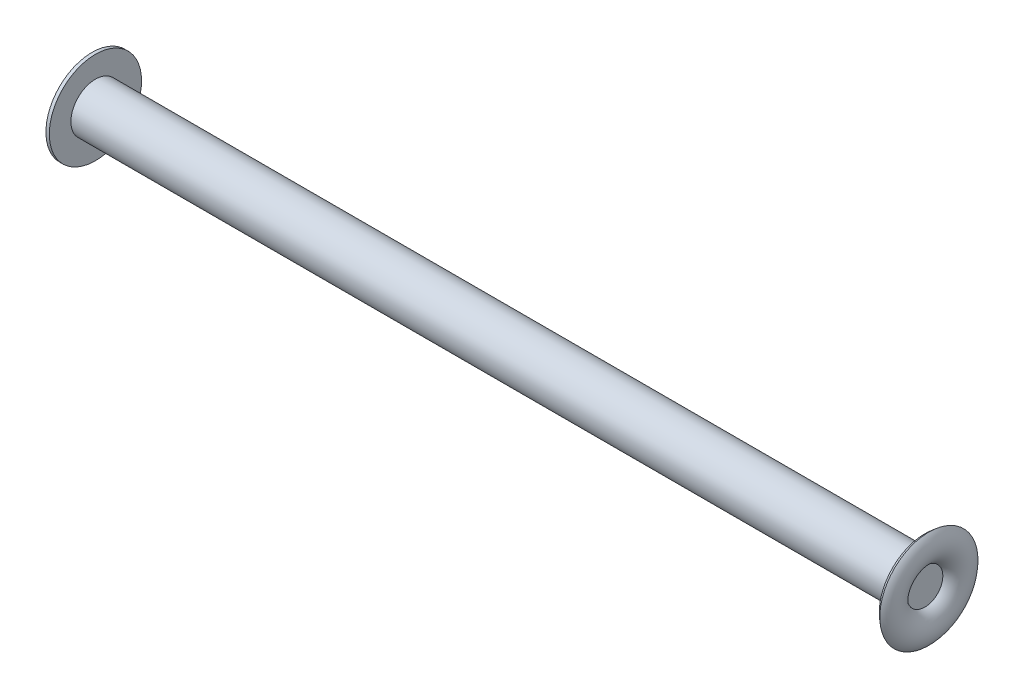
ISO-10303-21;
HEADER;
FILE_DESCRIPTION(('STEP AP214'),'2;1');
FILE_NAME('part.step','',(''),(''),'','','');
FILE_SCHEMA(('AUTOMOTIVE_DESIGN { 1 0 10303 214 1 1 1 1 }'));
ENDSEC;
DATA;
#1=APPLICATION_CONTEXT('core data for automotive mechanical design processes');
#2=APPLICATION_PROTOCOL_DEFINITION('international standard','automotive_design',2000,#1);
#3=PRODUCT_CONTEXT('',#1,'mechanical');
#4=PRODUCT('Part','Part','',(#3));
#5=PRODUCT_RELATED_PRODUCT_CATEGORY('part','',(#4));
#6=PRODUCT_DEFINITION_FORMATION('','',#4);
#7=PRODUCT_DEFINITION_CONTEXT('part definition',#1,'design');
#8=PRODUCT_DEFINITION('design','',#6,#7);
#9=PRODUCT_DEFINITION_SHAPE('','',#8);
#10=(LENGTH_UNIT() NAMED_UNIT(*) SI_UNIT(.MILLI.,.METRE.));
#11=(NAMED_UNIT(*) PLANE_ANGLE_UNIT() SI_UNIT($,.RADIAN.));
#12=(NAMED_UNIT(*) SI_UNIT($,.STERADIAN.) SOLID_ANGLE_UNIT());
#13=UNCERTAINTY_MEASURE_WITH_UNIT(LENGTH_MEASURE(1.E-05),#10,'distance_accuracy_value','');
#14=(GEOMETRIC_REPRESENTATION_CONTEXT(3) GLOBAL_UNCERTAINTY_ASSIGNED_CONTEXT((#13)) GLOBAL_UNIT_ASSIGNED_CONTEXT((#10,
#11,#12)) REPRESENTATION_CONTEXT('',''));
#15=CARTESIAN_POINT('',(0.,0.,0.));
#16=DIRECTION('',(0.,0.,1.));
#17=DIRECTION('',(1.,0.,0.));
#18=AXIS2_PLACEMENT_3D('',#15,#16,#17);
#19=CARTESIAN_POINT('',(49.784,0.,0.));
#20=DIRECTION('',(1.,0.,0.));
#21=DIRECTION('',(0.,0.,-1.));
#22=AXIS2_PLACEMENT_3D('',#19,#20,#21);
#23=PLANE('',#22);
#24=CARTESIAN_POINT('',(49.784,0.,0.));
#25=DIRECTION('',(1.,0.,0.));
#26=DIRECTION('',(0.,0.,-1.));
#27=AXIS2_PLACEMENT_3D('',#24,#25,#26);
#28=CIRCLE('',#27,1.07585685002164);
#29=CARTESIAN_POINT('',(49.784,0.,-1.07585685002164));
#30=VERTEX_POINT('',#29);
#31=EDGE_CURVE('E41',#30,#30,#28,.F.);
#32=ORIENTED_EDGE('',*,*,#31,.F.);
#33=EDGE_LOOP('',(#32));
#34=FACE_BOUND('',#33,.T.);
#35=ADVANCED_FACE('F16',(#34),#23,.T.);
#36=CARTESIAN_POINT('',(-0.9144,0.,0.));
#37=DIRECTION('',(-1.,0.,0.));
#38=DIRECTION('',(0.,0.,1.));
#39=AXIS2_PLACEMENT_3D('',#36,#37,#38);
#40=PLANE('',#39);
#41=CARTESIAN_POINT('',(-0.914399999999999,0.,0.));
#42=DIRECTION('',(1.,0.,0.));
#43=DIRECTION('',(0.,0.,-1.));
#44=AXIS2_PLACEMENT_3D('',#41,#42,#43);
#45=CIRCLE('',#44,0.0898598239255418);
#46=CARTESIAN_POINT('',(-0.9144,0.,-0.0898598239255401));
#47=VERTEX_POINT('',#46);
#48=CARTESIAN_POINT('',(-0.9144,0.,0.0898598239255401));
#49=VERTEX_POINT('',#48);
#50=EDGE_CURVE('E33',#47,#49,#45,.T.);
#51=ORIENTED_EDGE('',*,*,#50,.F.);
#52=CARTESIAN_POINT('',(-0.914399999999999,0.,0.));
#53=DIRECTION('',(1.,0.,0.));
#54=DIRECTION('',(0.,0.,1.));
#55=AXIS2_PLACEMENT_3D('',#52,#53,#54);
#56=CIRCLE('',#55,0.0898598239255418);
#57=EDGE_CURVE('E39',#49,#47,#56,.T.);
#58=ORIENTED_EDGE('',*,*,#57,.F.);
#59=EDGE_LOOP('',(#51,#58));
#60=FACE_BOUND('',#59,.T.);
#61=ADVANCED_FACE('F44',(#60),#40,.T.);
#62=CARTESIAN_POINT('',(49.149,0.,0.));
#63=DIRECTION('',(1.,0.,0.));
#64=DIRECTION('',(0.,0.,-1.));
#65=AXIS2_PLACEMENT_3D('',#62,#63,#64);
#66=TOROIDAL_SURFACE('',#65,2.1082,1.21200551950362);
#67=ORIENTED_EDGE('',*,*,#31,.T.);
#68=EDGE_LOOP('',(#67));
#69=FACE_BOUND('',#68,.T.);
#70=CARTESIAN_POINT('',(50.0244222242827,0.,0.));
#71=DIRECTION('',(1.,0.,0.));
#72=DIRECTION('',(0.,0.,-1.));
#73=AXIS2_PLACEMENT_3D('',#70,#71,#72);
#74=CIRCLE('',#73,2.94640839206295);
#75=CARTESIAN_POINT('',(50.0244222242827,0.,-2.94640839206295));
#76=VERTEX_POINT('',#75);
#77=EDGE_CURVE('E45',#76,#76,#74,.F.);
#78=ORIENTED_EDGE('',*,*,#77,.F.);
#79=EDGE_LOOP('',(#78));
#80=FACE_BOUND('',#79,.T.);
#81=ADVANCED_FACE('F61',(#69,#80),#66,.T.);
#82=CARTESIAN_POINT('',(4.82935854520074,0.,0.0013150851120964));
#83=DIRECTION('',(0.,1.,0.));
#84=DIRECTION('',(0.,0.,-1.));
#85=AXIS2_PLACEMENT_3D('',#82,#83,#84);
#86=CIRCLE('',#85,5.74448214285714);
#87=TRIMMED_CURVE('',#86,(PARAMETER_VALUE(-1.570567396651)),(PARAMETER_VALUE(1.570567396651)),
.T.,.PARAMETER.);
#88=CARTESIAN_POINT('',(4.82935854520074,0.,0.));
#89=DIRECTION('',(1.,0.,0.));
#90=AXIS1_PLACEMENT('',#88,#89);
#91=SURFACE_OF_REVOLUTION('',#87,#90);
#92=ORIENTED_EDGE('',*,*,#50,.T.);
#93=ORIENTED_EDGE('',*,*,#57,.T.);
#94=EDGE_LOOP('',(#92,#93));
#95=FACE_BOUND('',#94,.T.);
#96=CARTESIAN_POINT('',(-0.2032,0.,0.));
#97=DIRECTION('',(1.,0.,0.));
#98=DIRECTION('',(0.,0.,-1.));
#99=AXIS2_PLACEMENT_3D('',#96,#97,#98);
#100=CIRCLE('',#99,2.7686);
#101=CARTESIAN_POINT('',(-0.2032,0.,-2.7686));
#102=VERTEX_POINT('',#101);
#103=EDGE_CURVE('E72',#102,#102,#100,.T.);
#104=ORIENTED_EDGE('',*,*,#103,.F.);
#105=EDGE_LOOP('',(#104));
#106=FACE_BOUND('',#105,.T.);
#107=ADVANCED_FACE('F37',(#95,#106),#91,.F.);
#108=CARTESIAN_POINT('',(50.0244222242259,0.,0.));
#109=DIRECTION('',(1.,0.,0.));
#110=DIRECTION('',(0.,1.,0.));
#111=AXIS2_PLACEMENT_3D('',#108,#109,#110);
#112=CONICAL_SURFACE('',#111,2.94640839200611,0.701709367526113);
#113=ORIENTED_EDGE('',*,*,#77,.T.);
#114=EDGE_LOOP('',(#113));
#115=FACE_BOUND('',#114,.T.);
#116=CARTESIAN_POINT('',(49.784,0.,0.));
#117=DIRECTION('',(1.,0.,0.));
#118=DIRECTION('',(0.,0.,-1.));
#119=AXIS2_PLACEMENT_3D('',#116,#117,#118);
#120=CIRCLE('',#119,2.7432);
#121=CARTESIAN_POINT('',(49.784,0.,-2.7432));
#122=VERTEX_POINT('',#121);
#123=EDGE_CURVE('E77',#122,#122,#120,.T.);
#124=ORIENTED_EDGE('',*,*,#123,.T.);
#125=EDGE_LOOP('',(#124));
#126=FACE_BOUND('',#125,.T.);
#127=ADVANCED_FACE('F93',(#115,#126),#112,.T.);
#128=CARTESIAN_POINT('',(-0.9144,0.,0.));
#129=DIRECTION('',(1.,0.,0.));
#130=DIRECTION('',(0.,0.,-1.));
#131=AXIS2_PLACEMENT_3D('',#128,#129,#130);
#132=CYLINDRICAL_SURFACE('',#131,2.7686);
#133=ORIENTED_EDGE('',*,*,#103,.T.);
#134=EDGE_LOOP('',(#133));
#135=FACE_BOUND('',#134,.T.);
#136=CARTESIAN_POINT('',(0.,0.,0.));
#137=DIRECTION('',(1.,0.,0.));
#138=DIRECTION('',(0.,0.,-1.));
#139=AXIS2_PLACEMENT_3D('',#136,#137,#138);
#140=CIRCLE('',#139,2.7686);
#141=CARTESIAN_POINT('',(0.,0.,-2.7686));
#142=VERTEX_POINT('',#141);
#143=EDGE_CURVE('E80',#142,#142,#140,.F.);
#144=ORIENTED_EDGE('',*,*,#143,.T.);
#145=EDGE_LOOP('',(#144));
#146=FACE_BOUND('',#145,.T.);
#147=ADVANCED_FACE('F89',(#135,#146),#132,.T.);
#148=CARTESIAN_POINT('',(49.149,0.,0.));
#149=DIRECTION('',(1.,0.,0.));
#150=DIRECTION('',(0.,0.,-1.));
#151=AXIS2_PLACEMENT_3D('',#148,#149,#150);
#152=TOROIDAL_SURFACE('',#151,2.1082,0.898025612106913);
#153=ORIENTED_EDGE('',*,*,#123,.F.);
#154=EDGE_LOOP('',(#153));
#155=FACE_BOUND('',#154,.T.);
#156=CARTESIAN_POINT('',(49.784,0.,0.));
#157=DIRECTION('',(-1.,0.,0.));
#158=DIRECTION('',(0.,0.,1.));
#159=AXIS2_PLACEMENT_3D('',#156,#157,#158);
#160=CIRCLE('',#159,1.4732);
#161=CARTESIAN_POINT('',(49.784,0.,1.4732));
#162=VERTEX_POINT('',#161);
#163=EDGE_CURVE('E26',#162,#162,#160,.T.);
#164=ORIENTED_EDGE('',*,*,#163,.F.);
#165=EDGE_LOOP('',(#164));
#166=FACE_BOUND('',#165,.T.);
#167=ADVANCED_FACE('F84',(#155,#166),#152,.F.);
#168=CARTESIAN_POINT('',(0.,0.,0.));
#169=DIRECTION('',(-1.,0.,0.));
#170=DIRECTION('',(0.,0.,1.));
#171=AXIS2_PLACEMENT_3D('',#168,#169,#170);
#172=PLANE('',#171);
#173=CARTESIAN_POINT('',(0.,0.,0.));
#174=DIRECTION('',(-1.,0.,0.));
#175=DIRECTION('',(0.,0.,1.));
#176=AXIS2_PLACEMENT_3D('',#173,#174,#175);
#177=CIRCLE('',#176,1.4732);
#178=CARTESIAN_POINT('',(0.,0.,1.4732));
#179=VERTEX_POINT('',#178);
#180=EDGE_CURVE('E11',#179,#179,#177,.F.);
#181=ORIENTED_EDGE('',*,*,#180,.F.);
#182=EDGE_LOOP('',(#181));
#183=FACE_BOUND('',#182,.T.);
#184=ORIENTED_EDGE('',*,*,#143,.F.);
#185=EDGE_LOOP('',(#184));
#186=FACE_BOUND('',#185,.T.);
#187=ADVANCED_FACE('F88',(#183,#186),#172,.F.);
#188=CARTESIAN_POINT('',(49.784,0.,0.));
#189=DIRECTION('',(-1.,0.,0.));
#190=DIRECTION('',(0.,0.,1.));
#191=AXIS2_PLACEMENT_3D('',#188,#189,#190);
#192=CYLINDRICAL_SURFACE('',#191,1.4732);
#193=ORIENTED_EDGE('',*,*,#180,.T.);
#194=EDGE_LOOP('',(#193));
#195=FACE_BOUND('',#194,.T.);
#196=ORIENTED_EDGE('',*,*,#163,.T.);
#197=EDGE_LOOP('',(#196));
#198=FACE_BOUND('',#197,.T.);
#199=ADVANCED_FACE('F102',(#195,#198),#192,.T.);
#200=CLOSED_SHELL('',(#35,#61,#81,#107,#127,#147,#167,#187,#199));
#201=MANIFOLD_SOLID_BREP('B1',#200);
#202=ADVANCED_BREP_SHAPE_REPRESENTATION('',(#18,#201),#14);
#203=SHAPE_DEFINITION_REPRESENTATION(#9,#202);
ENDSEC;
END-ISO-10303-21;
